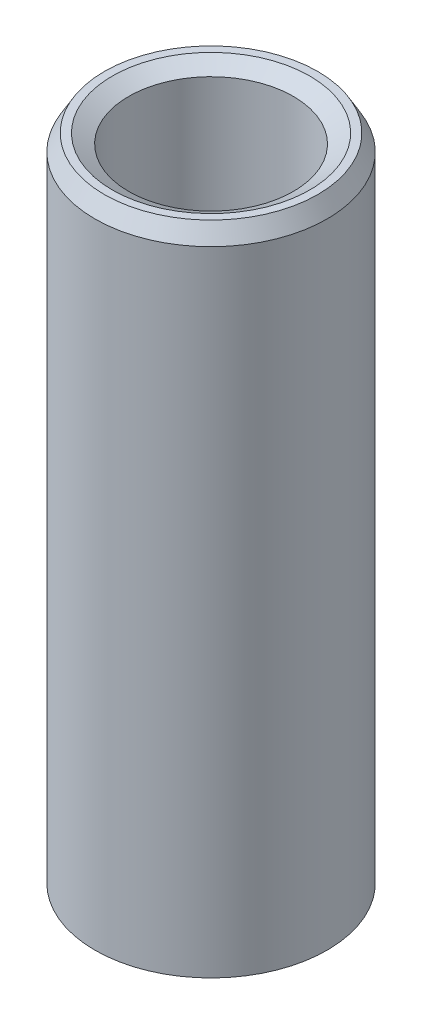
ISO-10303-21;
HEADER;
FILE_DESCRIPTION(('STEP AP214'),'2;1');
FILE_NAME('part.step','',(''),(''),'','','');
FILE_SCHEMA(('AUTOMOTIVE_DESIGN { 1 0 10303 214 1 1 1 1 }'));
ENDSEC;
DATA;
#1=APPLICATION_CONTEXT('core data for automotive mechanical design processes');
#2=APPLICATION_PROTOCOL_DEFINITION('international standard','automotive_design',2000,#1);
#3=PRODUCT_CONTEXT('',#1,'mechanical');
#4=PRODUCT('Part','Part','',(#3));
#5=PRODUCT_RELATED_PRODUCT_CATEGORY('part','',(#4));
#6=PRODUCT_DEFINITION_FORMATION('','',#4);
#7=PRODUCT_DEFINITION_CONTEXT('part definition',#1,'design');
#8=PRODUCT_DEFINITION('design','',#6,#7);
#9=PRODUCT_DEFINITION_SHAPE('','',#8);
#10=(LENGTH_UNIT() NAMED_UNIT(*) SI_UNIT(.MILLI.,.METRE.));
#11=(NAMED_UNIT(*) PLANE_ANGLE_UNIT() SI_UNIT($,.RADIAN.));
#12=(NAMED_UNIT(*) SI_UNIT($,.STERADIAN.) SOLID_ANGLE_UNIT());
#13=UNCERTAINTY_MEASURE_WITH_UNIT(LENGTH_MEASURE(1.E-05),#10,'distance_accuracy_value','');
#14=(GEOMETRIC_REPRESENTATION_CONTEXT(3) GLOBAL_UNCERTAINTY_ASSIGNED_CONTEXT((#13)) GLOBAL_UNIT_ASSIGNED_CONTEXT((#10,
#11,#12)) REPRESENTATION_CONTEXT('',''));
#15=CARTESIAN_POINT('',(0.,0.,0.));
#16=DIRECTION('',(0.,0.,1.));
#17=DIRECTION('',(1.,0.,0.));
#18=AXIS2_PLACEMENT_3D('',#15,#16,#17);
#19=CARTESIAN_POINT('',(0.,85.1324466521819,0.));
#20=DIRECTION('',(0.,-1.,0.));
#21=DIRECTION('',(0.,0.,-1.));
#22=AXIS2_PLACEMENT_3D('',#19,#20,#21);
#23=CYLINDRICAL_SURFACE('',#22,15.);
#24=CARTESIAN_POINT('',(0.,1.22079568022275,0.));
#25=DIRECTION('',(0.,1.,0.));
#26=DIRECTION('',(0.,0.,1.));
#27=AXIS2_PLACEMENT_3D('',#24,#25,#26);
#28=CIRCLE('',#27,15.);
#29=CARTESIAN_POINT('',(0.,1.22079568022275,15.));
#30=VERTEX_POINT('',#29);
#31=EDGE_CURVE('E10',#30,#30,#28,.T.);
#32=ORIENTED_EDGE('',*,*,#31,.T.);
#33=EDGE_LOOP('',(#32));
#34=FACE_BOUND('',#33,.T.);
#35=CARTESIAN_POINT('',(0.,83.0179665083755,0.));
#36=DIRECTION('',(0.,1.,0.));
#37=DIRECTION('',(0.,0.,1.));
#38=AXIS2_PLACEMENT_3D('',#35,#36,#37);
#39=CIRCLE('',#38,15.);
#40=CARTESIAN_POINT('',(0.,83.0179665083755,15.));
#41=VERTEX_POINT('',#40);
#42=EDGE_CURVE('E50',#41,#41,#39,.F.);
#43=ORIENTED_EDGE('',*,*,#42,.T.);
#44=EDGE_LOOP('',(#43));
#45=FACE_BOUND('',#44,.T.);
#46=ADVANCED_FACE('F39',(#34,#45),#23,.T.);
#47=CARTESIAN_POINT('',(0.,85.1324466521819,0.));
#48=DIRECTION('',(0.,1.,0.));
#49=DIRECTION('',(0.,0.,1.));
#50=AXIS2_PLACEMENT_3D('',#47,#48,#49);
#51=PLANE('',#50);
#52=CARTESIAN_POINT('',(0.,85.1324466521819,0.));
#53=DIRECTION('',(0.,1.,0.));
#54=DIRECTION('',(0.,0.,1.));
#55=AXIS2_PLACEMENT_3D('',#52,#53,#54);
#56=CIRCLE('',#55,12.7524814152333);
#57=CARTESIAN_POINT('',(0.,85.1324466521819,12.7524814152333));
#58=VERTEX_POINT('',#57);
#59=EDGE_CURVE('E58',#58,#58,#56,.F.);
#60=ORIENTED_EDGE('',*,*,#59,.T.);
#61=EDGE_LOOP('',(#60));
#62=FACE_BOUND('',#61,.T.);
#63=CARTESIAN_POINT('',(0.,85.1324466521819,0.));
#64=DIRECTION('',(0.,1.,0.));
#65=DIRECTION('',(0.,0.,1.));
#66=AXIS2_PLACEMENT_3D('',#63,#64,#65);
#67=CIRCLE('',#66,13.7792043197773);
#68=CARTESIAN_POINT('',(0.,85.1324466521819,13.7792043197773));
#69=VERTEX_POINT('',#68);
#70=EDGE_CURVE('E61',#69,#69,#67,.T.);
#71=ORIENTED_EDGE('',*,*,#70,.T.);
#72=EDGE_LOOP('',(#71));
#73=FACE_BOUND('',#72,.T.);
#74=ADVANCED_FACE('F88',(#62,#73),#51,.T.);
#75=CARTESIAN_POINT('',(0.,0.,0.));
#76=DIRECTION('',(0.,1.,0.));
#77=DIRECTION('',(0.,0.,1.));
#78=AXIS2_PLACEMENT_3D('',#75,#76,#77);
#79=PLANE('',#78);
#80=CARTESIAN_POINT('',(0.,0.,0.));
#81=DIRECTION('',(0.,1.,0.));
#82=DIRECTION('',(0.,0.,1.));
#83=AXIS2_PLACEMENT_3D('',#80,#81,#82);
#84=CIRCLE('',#83,11.8587969516496);
#85=CARTESIAN_POINT('',(0.,0.,-11.8587969516496));
#86=VERTEX_POINT('',#85);
#87=EDGE_CURVE('E51',#86,#86,#84,.T.);
#88=ORIENTED_EDGE('',*,*,#87,.T.);
#89=EDGE_LOOP('',(#88));
#90=FACE_BOUND('',#89,.T.);
#91=CARTESIAN_POINT('',(0.,0.,0.));
#92=DIRECTION('',(0.,1.,0.));
#93=DIRECTION('',(0.,0.,1.));
#94=AXIS2_PLACEMENT_3D('',#91,#92,#93);
#95=CIRCLE('',#94,12.8855198561936);
#96=CARTESIAN_POINT('',(0.,0.,12.8855198561936));
#97=VERTEX_POINT('',#96);
#98=EDGE_CURVE('E54',#97,#97,#95,.F.);
#99=ORIENTED_EDGE('',*,*,#98,.T.);
#100=EDGE_LOOP('',(#99));
#101=FACE_BOUND('',#100,.T.);
#102=ADVANCED_FACE('F83',(#90,#101),#79,.F.);
#103=CARTESIAN_POINT('',(0.,85.1324466521819,0.));
#104=DIRECTION('',(0.,-1.,0.));
#105=DIRECTION('',(0.,0.,-1.));
#106=AXIS2_PLACEMENT_3D('',#103,#104,#105);
#107=CYLINDRICAL_SURFACE('',#106,10.6380012714268);
#108=CARTESIAN_POINT('',(0.,83.9116509719591,0.));
#109=DIRECTION('',(0.,1.,0.));
#110=DIRECTION('',(0.,0.,1.));
#111=AXIS2_PLACEMENT_3D('',#108,#109,#110);
#112=CIRCLE('',#111,10.6380012714268);
#113=CARTESIAN_POINT('',(0.,83.9116509719591,10.6380012714268));
#114=VERTEX_POINT('',#113);
#115=EDGE_CURVE('E67',#114,#114,#112,.T.);
#116=ORIENTED_EDGE('',*,*,#115,.T.);
#117=EDGE_LOOP('',(#116));
#118=FACE_BOUND('',#117,.T.);
#119=CARTESIAN_POINT('',(0.,2.11448014380644,0.));
#120=DIRECTION('',(0.,1.,0.));
#121=DIRECTION('',(0.,0.,1.));
#122=AXIS2_PLACEMENT_3D('',#119,#120,#121);
#123=CIRCLE('',#122,10.6380012714268);
#124=CARTESIAN_POINT('',(0.,2.11448014380644,-10.6380012714268));
#125=VERTEX_POINT('',#124);
#126=EDGE_CURVE('E69',#125,#125,#123,.F.);
#127=ORIENTED_EDGE('',*,*,#126,.T.);
#128=EDGE_LOOP('',(#127));
#129=FACE_BOUND('',#128,.T.);
#130=ADVANCED_FACE('F71',(#118,#129),#107,.F.);
#131=CARTESIAN_POINT('',(0.,83.9116509719591,0.));
#132=DIRECTION('',(0.,1.,0.));
#133=DIRECTION('',(0.,0.,1.));
#134=AXIS2_PLACEMENT_3D('',#131,#132,#133);
#135=CONICAL_SURFACE('',#134,10.6380012714268,1.0471975511966);
#136=ORIENTED_EDGE('',*,*,#59,.F.);
#137=EDGE_LOOP('',(#136));
#138=FACE_BOUND('',#137,.T.);
#139=ORIENTED_EDGE('',*,*,#115,.F.);
#140=EDGE_LOOP('',(#139));
#141=FACE_BOUND('',#140,.T.);
#142=ADVANCED_FACE('F77',(#138,#141),#135,.F.);
#143=CARTESIAN_POINT('',(0.,0.,0.));
#144=DIRECTION('',(0.,-1.,0.));
#145=DIRECTION('',(0.,0.,-1.));
#146=AXIS2_PLACEMENT_3D('',#143,#144,#145);
#147=CONICAL_SURFACE('',#146,11.8587969516496,0.523598775598293);
#148=CARTESIAN_POINT('',(0.,2.11448014380644,-10.6380012714268));
#149=CARTESIAN_POINT('',(0.,2.09245430897512,-10.6507178930958));
#150=CARTESIAN_POINT('',(0.,2.07042847414381,-10.6634345147648));
#151=CARTESIAN_POINT('',(0.,2.02637680448117,-10.6888677581028));
#152=CARTESIAN_POINT('',(0.,2.00435096964986,-10.7015843797717));
#153=CARTESIAN_POINT('',(0.,1.96029929998722,-10.7270176231097));
#154=CARTESIAN_POINT('',(0.,1.9382734651559,-10.7397342447787));
#155=CARTESIAN_POINT('',(0.,1.89422179549327,-10.7651674881167));
#156=CARTESIAN_POINT('',(0.,1.87219596066195,-10.7778841097857));
#157=CARTESIAN_POINT('',(0.,1.82814429099932,-10.8033173531236));
#158=CARTESIAN_POINT('',(0.,1.806118456168,-10.8160339747926));
#159=CARTESIAN_POINT('',(0.,1.76206678650537,-10.8414672181306));
#160=CARTESIAN_POINT('',(0.,1.74004095167405,-10.8541838397996));
#161=CARTESIAN_POINT('',(0.,1.69598928201142,-10.8796170831376));
#162=CARTESIAN_POINT('',(0.,1.6739634471801,-10.8923337048065));
#163=CARTESIAN_POINT('',(0.,1.62991177751746,-10.9177669481445));
#164=CARTESIAN_POINT('',(0.,1.60788594268615,-10.9304835698135));
#165=CARTESIAN_POINT('',(0.,1.56383427302351,-10.9559168131515));
#166=CARTESIAN_POINT('',(0.,1.5418084381922,-10.9686334348205));
#167=CARTESIAN_POINT('',(0.,1.49775676852956,-10.9940666781584));
#168=CARTESIAN_POINT('',(0.,1.47573093369824,-11.0067832998274));
#169=CARTESIAN_POINT('',(0.,1.43167926403561,-11.0322165431654));
#170=CARTESIAN_POINT('',(0.,1.40965342920429,-11.0449331648344));
#171=CARTESIAN_POINT('',(0.,1.36560175954166,-11.0703664081724));
#172=CARTESIAN_POINT('',(0.,1.34357592471034,-11.0830830298414));
#173=CARTESIAN_POINT('',(0.,1.29952425504771,-11.1085162731793));
#174=CARTESIAN_POINT('',(0.,1.27749842021639,-11.1212328948483));
#175=CARTESIAN_POINT('',(0.,1.23344675055376,-11.1466661381863));
#176=CARTESIAN_POINT('',(0.,1.21142091572244,-11.1593827598553));
#177=CARTESIAN_POINT('',(0.,1.16736924605981,-11.1848160031933));
#178=CARTESIAN_POINT('',(0.,1.14534341122849,-11.1975326248622));
#179=CARTESIAN_POINT('',(0.,1.10129174156585,-11.2229658682002));
#180=CARTESIAN_POINT('',(0.,1.07926590673454,-11.2356824898692));
#181=CARTESIAN_POINT('',(0.,1.0352142370719,-11.2611157332072));
#182=CARTESIAN_POINT('',(0.,1.01318840224059,-11.2738323548762));
#183=CARTESIAN_POINT('',(0.,0.969136732577952,-11.2992655982141));
#184=CARTESIAN_POINT('',(0.,0.947110897746635,-11.3119822198831));
#185=CARTESIAN_POINT('',(0.,0.903059228084001,-11.3374154632211));
#186=CARTESIAN_POINT('',(0.,0.881033393252684,-11.3501320848901));
#187=CARTESIAN_POINT('',(0.,0.836981723590049,-11.3755653282281));
#188=CARTESIAN_POINT('',(0.,0.814955888758732,-11.388281949897));
#189=CARTESIAN_POINT('',(0.,0.770904219096098,-11.413715193235));
#190=CARTESIAN_POINT('',(0.,0.748878384264781,-11.426431814904));
#191=CARTESIAN_POINT('',(0.,0.704826714602147,-11.451865058242));
#192=CARTESIAN_POINT('',(0.,0.68280087977083,-11.464581679911));
#193=CARTESIAN_POINT('',(0.,0.638749210108196,-11.4900149232489));
#194=CARTESIAN_POINT('',(0.,0.616723375276878,-11.5027315449179));
#195=CARTESIAN_POINT('',(0.,0.572671705614244,-11.5281647882559));
#196=CARTESIAN_POINT('',(0.,0.550645870782927,-11.5408814099249));
#197=CARTESIAN_POINT('',(0.,0.506594201120293,-11.5663146532629));
#198=CARTESIAN_POINT('',(0.,0.484568366288976,-11.5790312749319));
#199=CARTESIAN_POINT('',(0.,0.440516696626342,-11.6044645182698));
#200=CARTESIAN_POINT('',(0.,0.418490861795025,-11.6171811399388));
#201=CARTESIAN_POINT('',(0.,0.37443919213239,-11.6426143832768));
#202=CARTESIAN_POINT('',(0.,0.352413357301073,-11.6553310049458));
#203=CARTESIAN_POINT('',(0.,0.308361687638439,-11.6807642482837));
#204=CARTESIAN_POINT('',(0.,0.286335852807122,-11.6934808699527));
#205=CARTESIAN_POINT('',(0.,0.242284183144488,-11.7189141132907));
#206=CARTESIAN_POINT('',(0.,0.220258348313171,-11.7316307349597));
#207=CARTESIAN_POINT('',(0.,0.176206678650537,-11.7570639782977));
#208=CARTESIAN_POINT('',(0.,0.15418084381922,-11.7697805999667));
#209=CARTESIAN_POINT('',(0.,0.110129174156585,-11.7952138433046));
#210=CARTESIAN_POINT('',(0.,0.0881033393252683,-11.8079304649736));
#211=CARTESIAN_POINT('',(0.,0.0440516696626343,-11.8333637083116));
#212=CARTESIAN_POINT('',(0.,0.0220258348313173,-11.8460803299806));
#213=CARTESIAN_POINT('',(0.,0.,-11.8587969516496));
#214=B_SPLINE_CURVE_WITH_KNOTS('',3,(#148,#149,#150,#151,#152,#153,#154,#155,#156,#157,#158,
#159,#160,#161,#162,#163,#164,#165,#166,#167,#168,#169,#170,#171,#172,#173,#174,#175,#176,#177,
#178,#179,#180,#181,#182,#183,#184,#185,#186,#187,#188,#189,#190,#191,#192,#193,#194,#195,#196,
#197,#198,#199,#200,#201,#202,#203,#204,#205,#206,#207,#208,#209,#210,#211,#212,#213),
.UNSPECIFIED.,.F.,.F.,(4,2,2,2,2,2,2,2,2,2,2,2,2,2,2,2,2,2,2,2,2,2,2,2,2,2,2,2,2,2,2,2,4),(0.,
0.0762997300139229,0.152599460027845,0.228899190041768,0.30519892005569,0.381498650069613,
0.457798380083536,0.534098110097458,0.610397840111381,0.686697570125304,0.762997300139227,
0.83929703015315,0.915596760167072,0.991896490180995,1.06819622019492,1.14449595020884,
1.22079568022276,1.29709541023669,1.37339514025061,1.44969487026453,1.52599460027845,
1.60229433029238,1.6785940603063,1.75489379032022,1.83119352033415,1.90749325034807,
1.98379298036199,2.06009271037591,2.13639244038984,2.21269217040376,2.28899190041768,
2.3652916304316,2.44159136044553),.UNSPECIFIED.);
#215=EDGE_CURVE('BSEAM73',#125,#86,#214,.T.);
#216=ORIENTED_EDGE('',*,*,#126,.F.);
#217=ORIENTED_EDGE('',*,*,#87,.F.);
#218=ORIENTED_EDGE('',*,*,#215,.T.);
#219=ORIENTED_EDGE('',*,*,#215,.F.);
#220=EDGE_LOOP('',(#216,#218,#217,#219));
#221=FACE_BOUND('',#220,.T.);
#222=ADVANCED_FACE('F73',(#221),#147,.F.);
#223=CARTESIAN_POINT('',(0.,1.22079568022275,0.));
#224=DIRECTION('',(0.,1.,0.));
#225=DIRECTION('',(0.,0.,1.));
#226=AXIS2_PLACEMENT_3D('',#223,#224,#225);
#227=CONICAL_SURFACE('',#226,15.,1.0471975511966);
#228=ORIENTED_EDGE('',*,*,#98,.F.);
#229=EDGE_LOOP('',(#228));
#230=FACE_BOUND('',#229,.T.);
#231=ORIENTED_EDGE('',*,*,#31,.F.);
#232=EDGE_LOOP('',(#231));
#233=FACE_BOUND('',#232,.T.);
#234=ADVANCED_FACE('F76',(#230,#233),#227,.T.);
#235=CARTESIAN_POINT('',(0.,85.1324466521819,0.));
#236=DIRECTION('',(0.,-1.,0.));
#237=DIRECTION('',(0.,0.,-1.));
#238=AXIS2_PLACEMENT_3D('',#235,#236,#237);
#239=CONICAL_SURFACE('',#238,13.7792043197773,0.523598775598293);
#240=ORIENTED_EDGE('',*,*,#42,.F.);
#241=EDGE_LOOP('',(#240));
#242=FACE_BOUND('',#241,.T.);
#243=ORIENTED_EDGE('',*,*,#70,.F.);
#244=EDGE_LOOP('',(#243));
#245=FACE_BOUND('',#244,.T.);
#246=ADVANCED_FACE('F45',(#242,#245),#239,.T.);
#247=CLOSED_SHELL('',(#46,#74,#102,#130,#142,#222,#234,#246));
#248=MANIFOLD_SOLID_BREP('B2',#247);
#249=ADVANCED_BREP_SHAPE_REPRESENTATION('',(#18,#248),#14);
#250=SHAPE_DEFINITION_REPRESENTATION(#9,#249);
ENDSEC;
END-ISO-10303-21;
